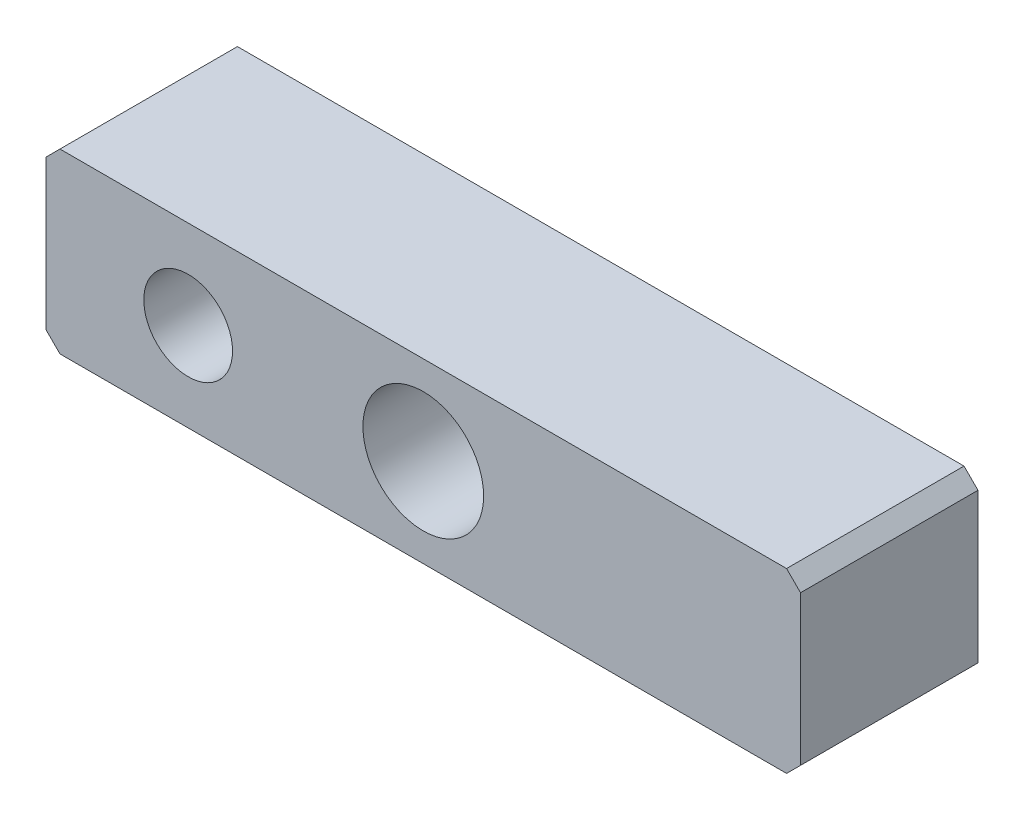
ISO-10303-21;
HEADER;
FILE_DESCRIPTION(('STEP AP214'),'2;1');
FILE_NAME('part.step','',(''),(''),'','','');
FILE_SCHEMA(('AUTOMOTIVE_DESIGN { 1 0 10303 214 1 1 1 1 }'));
ENDSEC;
DATA;
#1=APPLICATION_CONTEXT('core data for automotive mechanical design processes');
#2=APPLICATION_PROTOCOL_DEFINITION('international standard','automotive_design',2000,#1);
#3=PRODUCT_CONTEXT('',#1,'mechanical');
#4=PRODUCT('Part','Part','',(#3));
#5=PRODUCT_RELATED_PRODUCT_CATEGORY('part','',(#4));
#6=PRODUCT_DEFINITION_FORMATION('','',#4);
#7=PRODUCT_DEFINITION_CONTEXT('part definition',#1,'design');
#8=PRODUCT_DEFINITION('design','',#6,#7);
#9=PRODUCT_DEFINITION_SHAPE('','',#8);
#10=(LENGTH_UNIT() NAMED_UNIT(*) SI_UNIT(.MILLI.,.METRE.));
#11=(NAMED_UNIT(*) PLANE_ANGLE_UNIT() SI_UNIT($,.RADIAN.));
#12=(NAMED_UNIT(*) SI_UNIT($,.STERADIAN.) SOLID_ANGLE_UNIT());
#13=UNCERTAINTY_MEASURE_WITH_UNIT(LENGTH_MEASURE(1.E-05),#10,'distance_accuracy_value','');
#14=(GEOMETRIC_REPRESENTATION_CONTEXT(3) GLOBAL_UNCERTAINTY_ASSIGNED_CONTEXT((#13)) GLOBAL_UNIT_ASSIGNED_CONTEXT((#10,
#11,#12)) REPRESENTATION_CONTEXT('',''));
#15=CARTESIAN_POINT('',(0.,0.,0.));
#16=DIRECTION('',(0.,0.,1.));
#17=DIRECTION('',(1.,0.,0.));
#18=AXIS2_PLACEMENT_3D('',#15,#16,#17);
#19=CARTESIAN_POINT('',(0.,6.35,6.35));
#20=DIRECTION('',(0.,0.,-1.));
#21=DIRECTION('',(-1.,0.,0.));
#22=AXIS2_PLACEMENT_3D('',#19,#20,#21);
#23=PLANE('',#22);
#24=DIRECTION('',(0.,-1.,0.));
#25=VECTOR('',#24,1.);
#26=CARTESIAN_POINT('',(0.,0.,6.35));
#27=LINE('',#26,#25);
#28=CARTESIAN_POINT('',(0.,5.85,6.35));
#29=VERTEX_POINT('',#28);
#30=CARTESIAN_POINT('',(0.,0.500000000000004,6.35));
#31=VERTEX_POINT('',#30);
#32=EDGE_CURVE('E136',#29,#31,#27,.T.);
#33=ORIENTED_EDGE('',*,*,#32,.T.);
#34=DIRECTION('',(-0.707106781186545,0.70710678118655,0.));
#35=VECTOR('',#34,1.);
#36=CARTESIAN_POINT('',(0.5,0.,6.35));
#37=LINE('',#36,#35);
#38=CARTESIAN_POINT('',(0.5,0.,6.35));
#39=VERTEX_POINT('',#38);
#40=EDGE_CURVE('E151',#31,#39,#37,.F.);
#41=ORIENTED_EDGE('',*,*,#40,.T.);
#42=DIRECTION('',(1.,0.,0.));
#43=VECTOR('',#42,1.);
#44=CARTESIAN_POINT('',(0.,0.,6.35));
#45=LINE('',#44,#43);
#46=CARTESIAN_POINT('',(26.5,0.,6.35));
#47=VERTEX_POINT('',#46);
#48=EDGE_CURVE('E118',#39,#47,#45,.T.);
#49=ORIENTED_EDGE('',*,*,#48,.T.);
#50=DIRECTION('',(-0.70710678118655,-0.707106781186545,0.));
#51=VECTOR('',#50,1.);
#52=CARTESIAN_POINT('',(27.,0.5,6.35));
#53=LINE('',#52,#51);
#54=CARTESIAN_POINT('',(27.,0.5,6.35));
#55=VERTEX_POINT('',#54);
#56=EDGE_CURVE('E146',#47,#55,#53,.F.);
#57=ORIENTED_EDGE('',*,*,#56,.T.);
#58=DIRECTION('',(0.,1.,0.));
#59=VECTOR('',#58,1.);
#60=CARTESIAN_POINT('',(27.,0.,6.35));
#61=LINE('',#60,#59);
#62=CARTESIAN_POINT('',(27.,5.85,6.35));
#63=VERTEX_POINT('',#62);
#64=EDGE_CURVE('E162',#55,#63,#61,.T.);
#65=ORIENTED_EDGE('',*,*,#64,.T.);
#66=DIRECTION('',(0.707106781186543,-0.707106781186552,0.));
#67=VECTOR('',#66,1.);
#68=CARTESIAN_POINT('',(26.5,6.35,6.35));
#69=LINE('',#68,#67);
#70=CARTESIAN_POINT('',(26.5,6.35,6.35));
#71=VERTEX_POINT('',#70);
#72=EDGE_CURVE('E54',#63,#71,#69,.F.);
#73=ORIENTED_EDGE('',*,*,#72,.T.);
#74=DIRECTION('',(-1.,0.,0.));
#75=VECTOR('',#74,1.);
#76=CARTESIAN_POINT('',(0.,6.35,6.35));
#77=LINE('',#76,#75);
#78=CARTESIAN_POINT('',(0.500000000000004,6.35,6.35));
#79=VERTEX_POINT('',#78);
#80=EDGE_CURVE('E137',#71,#79,#77,.T.);
#81=ORIENTED_EDGE('',*,*,#80,.T.);
#82=DIRECTION('',(0.70710678118655,0.707106781186545,0.));
#83=VECTOR('',#82,1.);
#84=CARTESIAN_POINT('',(0.,5.85,6.35));
#85=LINE('',#84,#83);
#86=EDGE_CURVE('E149',#79,#29,#85,.F.);
#87=ORIENTED_EDGE('',*,*,#86,.T.);
#88=EDGE_LOOP('',(#33,#41,#49,#57,#65,#73,#81,#87));
#89=FACE_BOUND('',#88,.T.);
#90=CARTESIAN_POINT('',(13.5,3.175,6.35));
#91=DIRECTION('',(0.,0.,1.));
#92=DIRECTION('',(1.,0.,0.));
#93=AXIS2_PLACEMENT_3D('',#90,#91,#92);
#94=CIRCLE('',#93,2.16);
#95=CARTESIAN_POINT('',(15.66,3.175,6.35));
#96=VERTEX_POINT('',#95);
#97=EDGE_CURVE('E131',#96,#96,#94,.T.);
#98=ORIENTED_EDGE('',*,*,#97,.F.);
#99=EDGE_LOOP('',(#98));
#100=FACE_BOUND('',#99,.T.);
#101=CARTESIAN_POINT('',(5.0875,3.175,6.35));
#102=DIRECTION('',(0.,0.,1.));
#103=DIRECTION('',(1.,0.,0.));
#104=AXIS2_PLACEMENT_3D('',#101,#102,#103);
#105=CIRCLE('',#104,1.5875);
#106=CARTESIAN_POINT('',(6.675,3.175,6.35));
#107=VERTEX_POINT('',#106);
#108=EDGE_CURVE('E179',#107,#107,#105,.T.);
#109=ORIENTED_EDGE('',*,*,#108,.F.);
#110=EDGE_LOOP('',(#109));
#111=FACE_BOUND('',#110,.T.);
#112=ADVANCED_FACE('F32',(#89,#100,#111),#23,.F.);
#113=CARTESIAN_POINT('',(0.,6.35,0.));
#114=DIRECTION('',(0.,0.,-1.));
#115=DIRECTION('',(-1.,0.,0.));
#116=AXIS2_PLACEMENT_3D('',#113,#114,#115);
#117=PLANE('',#116);
#118=CARTESIAN_POINT('',(13.5,3.175,0.));
#119=DIRECTION('',(0.,0.,1.));
#120=DIRECTION('',(1.,0.,0.));
#121=AXIS2_PLACEMENT_3D('',#118,#119,#120);
#122=CIRCLE('',#121,2.16);
#123=CARTESIAN_POINT('',(15.66,3.175,0.));
#124=VERTEX_POINT('',#123);
#125=EDGE_CURVE('E176',#124,#124,#122,.T.);
#126=ORIENTED_EDGE('',*,*,#125,.T.);
#127=EDGE_LOOP('',(#126));
#128=FACE_BOUND('',#127,.T.);
#129=DIRECTION('',(1.,0.,0.));
#130=VECTOR('',#129,1.);
#131=CARTESIAN_POINT('',(0.,0.,0.));
#132=LINE('',#131,#130);
#133=CARTESIAN_POINT('',(0.5,0.,0.));
#134=VERTEX_POINT('',#133);
#135=CARTESIAN_POINT('',(26.5,0.,0.));
#136=VERTEX_POINT('',#135);
#137=EDGE_CURVE('E115',#134,#136,#132,.T.);
#138=ORIENTED_EDGE('',*,*,#137,.F.);
#139=DIRECTION('',(0.707106781186545,-0.70710678118655,0.));
#140=VECTOR('',#139,1.);
#141=CARTESIAN_POINT('',(-2.925,3.42500000000002,0.));
#142=LINE('',#141,#140);
#143=CARTESIAN_POINT('',(0.,0.500000000000004,0.));
#144=VERTEX_POINT('',#143);
#145=EDGE_CURVE('E98',#134,#144,#142,.F.);
#146=ORIENTED_EDGE('',*,*,#145,.T.);
#147=DIRECTION('',(0.,-1.,0.));
#148=VECTOR('',#147,1.);
#149=CARTESIAN_POINT('',(0.,0.,0.));
#150=LINE('',#149,#148);
#151=CARTESIAN_POINT('',(0.,5.85,0.));
#152=VERTEX_POINT('',#151);
#153=EDGE_CURVE('E126',#152,#144,#150,.T.);
#154=ORIENTED_EDGE('',*,*,#153,.F.);
#155=DIRECTION('',(-0.70710678118655,-0.707106781186545,0.));
#156=VECTOR('',#155,1.);
#157=CARTESIAN_POINT('',(0.25,6.1,0.));
#158=LINE('',#157,#156);
#159=CARTESIAN_POINT('',(0.500000000000004,6.35,0.));
#160=VERTEX_POINT('',#159);
#161=EDGE_CURVE('E109',#152,#160,#158,.F.);
#162=ORIENTED_EDGE('',*,*,#161,.T.);
#163=DIRECTION('',(-1.,0.,0.));
#164=VECTOR('',#163,1.);
#165=CARTESIAN_POINT('',(0.,6.35,0.));
#166=LINE('',#165,#164);
#167=CARTESIAN_POINT('',(26.5,6.35,0.));
#168=VERTEX_POINT('',#167);
#169=EDGE_CURVE('E129',#168,#160,#166,.T.);
#170=ORIENTED_EDGE('',*,*,#169,.F.);
#171=DIRECTION('',(-0.707106781186543,0.707106781186552,0.));
#172=VECTOR('',#171,1.);
#173=CARTESIAN_POINT('',(13.2500000000002,19.6,0.));
#174=LINE('',#173,#172);
#175=CARTESIAN_POINT('',(27.,5.85,0.));
#176=VERTEX_POINT('',#175);
#177=EDGE_CURVE('E140',#168,#176,#174,.F.);
#178=ORIENTED_EDGE('',*,*,#177,.T.);
#179=DIRECTION('',(0.,1.,0.));
#180=VECTOR('',#179,1.);
#181=CARTESIAN_POINT('',(27.,0.,0.));
#182=LINE('',#181,#180);
#183=CARTESIAN_POINT('',(27.,0.5,0.));
#184=VERTEX_POINT('',#183);
#185=EDGE_CURVE('E125',#184,#176,#182,.T.);
#186=ORIENTED_EDGE('',*,*,#185,.F.);
#187=DIRECTION('',(0.70710678118655,0.707106781186545,0.));
#188=VECTOR('',#187,1.);
#189=CARTESIAN_POINT('',(16.4249999999999,-10.075,0.));
#190=LINE('',#189,#188);
#191=EDGE_CURVE('E119',#184,#136,#190,.F.);
#192=ORIENTED_EDGE('',*,*,#191,.T.);
#193=EDGE_LOOP('',(#138,#146,#154,#162,#170,#178,#186,#192));
#194=FACE_BOUND('',#193,.T.);
#195=CARTESIAN_POINT('',(5.0875,3.175,0.));
#196=DIRECTION('',(0.,0.,1.));
#197=DIRECTION('',(1.,0.,0.));
#198=AXIS2_PLACEMENT_3D('',#195,#196,#197);
#199=CIRCLE('',#198,1.5875);
#200=CARTESIAN_POINT('',(6.675,3.175,0.));
#201=VERTEX_POINT('',#200);
#202=EDGE_CURVE('E182',#201,#201,#199,.T.);
#203=ORIENTED_EDGE('',*,*,#202,.T.);
#204=EDGE_LOOP('',(#203));
#205=FACE_BOUND('',#204,.T.);
#206=ADVANCED_FACE('F122',(#128,#194,#205),#117,.T.);
#207=CARTESIAN_POINT('',(0.,0.,6.35));
#208=DIRECTION('',(1.,0.,0.));
#209=DIRECTION('',(0.,0.,-1.));
#210=AXIS2_PLACEMENT_3D('',#207,#208,#209);
#211=PLANE('',#210);
#212=ORIENTED_EDGE('',*,*,#153,.T.);
#213=DIRECTION('',(0.,0.,1.));
#214=VECTOR('',#213,1.);
#215=CARTESIAN_POINT('',(0.,0.500000000000004,6.35));
#216=LINE('',#215,#214);
#217=EDGE_CURVE('E103',#144,#31,#216,.T.);
#218=ORIENTED_EDGE('',*,*,#217,.T.);
#219=ORIENTED_EDGE('',*,*,#32,.F.);
#220=DIRECTION('',(0.,0.,-1.));
#221=VECTOR('',#220,1.);
#222=CARTESIAN_POINT('',(0.,5.85,6.35));
#223=LINE('',#222,#221);
#224=EDGE_CURVE('E108',#29,#152,#223,.T.);
#225=ORIENTED_EDGE('',*,*,#224,.T.);
#226=EDGE_LOOP('',(#212,#218,#219,#225));
#227=FACE_BOUND('',#226,.T.);
#228=ADVANCED_FACE('F196',(#227),#211,.F.);
#229=CARTESIAN_POINT('',(0.,0.,6.35));
#230=DIRECTION('',(0.,1.,0.));
#231=DIRECTION('',(0.,0.,1.));
#232=AXIS2_PLACEMENT_3D('',#229,#230,#231);
#233=PLANE('',#232);
#234=ORIENTED_EDGE('',*,*,#48,.F.);
#235=DIRECTION('',(0.,0.,-1.));
#236=VECTOR('',#235,1.);
#237=CARTESIAN_POINT('',(0.5,0.,6.35));
#238=LINE('',#237,#236);
#239=EDGE_CURVE('E102',#39,#134,#238,.T.);
#240=ORIENTED_EDGE('',*,*,#239,.T.);
#241=ORIENTED_EDGE('',*,*,#137,.T.);
#242=DIRECTION('',(0.,0.,1.));
#243=VECTOR('',#242,1.);
#244=CARTESIAN_POINT('',(26.5,0.,6.35));
#245=LINE('',#244,#243);
#246=EDGE_CURVE('E120',#136,#47,#245,.T.);
#247=ORIENTED_EDGE('',*,*,#246,.T.);
#248=EDGE_LOOP('',(#234,#240,#241,#247));
#249=FACE_BOUND('',#248,.T.);
#250=ADVANCED_FACE('F114',(#249),#233,.F.);
#251=CARTESIAN_POINT('',(27.,0.,6.35));
#252=DIRECTION('',(-1.,0.,0.));
#253=DIRECTION('',(0.,0.,1.));
#254=AXIS2_PLACEMENT_3D('',#251,#252,#253);
#255=PLANE('',#254);
#256=ORIENTED_EDGE('',*,*,#185,.T.);
#257=DIRECTION('',(0.,0.,1.));
#258=VECTOR('',#257,1.);
#259=CARTESIAN_POINT('',(27.,5.85,6.35));
#260=LINE('',#259,#258);
#261=EDGE_CURVE('E11',#176,#63,#260,.T.);
#262=ORIENTED_EDGE('',*,*,#261,.T.);
#263=ORIENTED_EDGE('',*,*,#64,.F.);
#264=DIRECTION('',(0.,0.,-1.));
#265=VECTOR('',#264,1.);
#266=CARTESIAN_POINT('',(27.,0.5,6.35));
#267=LINE('',#266,#265);
#268=EDGE_CURVE('E40',#55,#184,#267,.T.);
#269=ORIENTED_EDGE('',*,*,#268,.T.);
#270=EDGE_LOOP('',(#256,#262,#263,#269));
#271=FACE_BOUND('',#270,.T.);
#272=ADVANCED_FACE('F160',(#271),#255,.F.);
#273=CARTESIAN_POINT('',(0.,6.35,6.35));
#274=DIRECTION('',(0.,-1.,0.));
#275=DIRECTION('',(0.,0.,-1.));
#276=AXIS2_PLACEMENT_3D('',#273,#274,#275);
#277=PLANE('',#276);
#278=ORIENTED_EDGE('',*,*,#169,.T.);
#279=DIRECTION('',(0.,0.,1.));
#280=VECTOR('',#279,1.);
#281=CARTESIAN_POINT('',(0.500000000000004,6.35,6.35));
#282=LINE('',#281,#280);
#283=EDGE_CURVE('E47',#160,#79,#282,.T.);
#284=ORIENTED_EDGE('',*,*,#283,.T.);
#285=ORIENTED_EDGE('',*,*,#80,.F.);
#286=DIRECTION('',(0.,0.,-1.));
#287=VECTOR('',#286,1.);
#288=CARTESIAN_POINT('',(26.5,6.35,6.35));
#289=LINE('',#288,#287);
#290=EDGE_CURVE('E153',#71,#168,#289,.T.);
#291=ORIENTED_EDGE('',*,*,#290,.T.);
#292=EDGE_LOOP('',(#278,#284,#285,#291));
#293=FACE_BOUND('',#292,.T.);
#294=ADVANCED_FACE('F169',(#293),#277,.F.);
#295=CARTESIAN_POINT('',(13.5,3.175,6.35));
#296=DIRECTION('',(0.,0.,-1.));
#297=DIRECTION('',(-1.,0.,0.));
#298=AXIS2_PLACEMENT_3D('',#295,#296,#297);
#299=CYLINDRICAL_SURFACE('',#298,2.16);
#300=ORIENTED_EDGE('',*,*,#97,.T.);
#301=EDGE_LOOP('',(#300));
#302=FACE_BOUND('',#301,.T.);
#303=ORIENTED_EDGE('',*,*,#125,.F.);
#304=EDGE_LOOP('',(#303));
#305=FACE_BOUND('',#304,.T.);
#306=ADVANCED_FACE('F201',(#302,#305),#299,.F.);
#307=CARTESIAN_POINT('',(5.0875,3.175,6.35));
#308=DIRECTION('',(0.,0.,-1.));
#309=DIRECTION('',(-1.,0.,0.));
#310=AXIS2_PLACEMENT_3D('',#307,#308,#309);
#311=CYLINDRICAL_SURFACE('',#310,1.5875);
#312=ORIENTED_EDGE('',*,*,#108,.T.);
#313=EDGE_LOOP('',(#312));
#314=FACE_BOUND('',#313,.T.);
#315=ORIENTED_EDGE('',*,*,#202,.F.);
#316=EDGE_LOOP('',(#315));
#317=FACE_BOUND('',#316,.T.);
#318=ADVANCED_FACE('F188',(#314,#317),#311,.F.);
#319=CARTESIAN_POINT('',(0.5,0.,6.35));
#320=DIRECTION('',(0.70710678118655,0.707106781186545,0.));
#321=DIRECTION('',(0.,0.,-1.));
#322=AXIS2_PLACEMENT_3D('',#319,#320,#321);
#323=PLANE('',#322);
#324=ORIENTED_EDGE('',*,*,#40,.F.);
#325=ORIENTED_EDGE('',*,*,#217,.F.);
#326=ORIENTED_EDGE('',*,*,#145,.F.);
#327=ORIENTED_EDGE('',*,*,#239,.F.);
#328=EDGE_LOOP('',(#324,#325,#326,#327));
#329=FACE_BOUND('',#328,.T.);
#330=ADVANCED_FACE('F101',(#329),#323,.F.);
#331=CARTESIAN_POINT('',(0.,5.85,6.35));
#332=DIRECTION('',(0.707106781186545,-0.70710678118655,0.));
#333=DIRECTION('',(0.,0.,-1.));
#334=AXIS2_PLACEMENT_3D('',#331,#332,#333);
#335=PLANE('',#334);
#336=ORIENTED_EDGE('',*,*,#86,.F.);
#337=ORIENTED_EDGE('',*,*,#283,.F.);
#338=ORIENTED_EDGE('',*,*,#161,.F.);
#339=ORIENTED_EDGE('',*,*,#224,.F.);
#340=EDGE_LOOP('',(#336,#337,#338,#339));
#341=FACE_BOUND('',#340,.T.);
#342=ADVANCED_FACE('F215',(#341),#335,.F.);
#343=CARTESIAN_POINT('',(26.5,6.35,6.35));
#344=DIRECTION('',(-0.707106781186552,-0.707106781186543,0.));
#345=DIRECTION('',(0.,0.,-1.));
#346=AXIS2_PLACEMENT_3D('',#343,#344,#345);
#347=PLANE('',#346);
#348=ORIENTED_EDGE('',*,*,#72,.F.);
#349=ORIENTED_EDGE('',*,*,#261,.F.);
#350=ORIENTED_EDGE('',*,*,#177,.F.);
#351=ORIENTED_EDGE('',*,*,#290,.F.);
#352=EDGE_LOOP('',(#348,#349,#350,#351));
#353=FACE_BOUND('',#352,.T.);
#354=ADVANCED_FACE('F168',(#353),#347,.F.);
#355=CARTESIAN_POINT('',(27.,0.5,6.35));
#356=DIRECTION('',(-0.707106781186545,0.70710678118655,0.));
#357=DIRECTION('',(0.,0.,-1.));
#358=AXIS2_PLACEMENT_3D('',#355,#356,#357);
#359=PLANE('',#358);
#360=ORIENTED_EDGE('',*,*,#56,.F.);
#361=ORIENTED_EDGE('',*,*,#246,.F.);
#362=ORIENTED_EDGE('',*,*,#191,.F.);
#363=ORIENTED_EDGE('',*,*,#268,.F.);
#364=EDGE_LOOP('',(#360,#361,#362,#363));
#365=FACE_BOUND('',#364,.T.);
#366=ADVANCED_FACE('F34',(#365),#359,.F.);
#367=CLOSED_SHELL('',(#112,#206,#228,#250,#272,#294,#306,#318,#330,#342,#354,#366));
#368=MANIFOLD_SOLID_BREP('B2',#367);
#369=ADVANCED_BREP_SHAPE_REPRESENTATION('',(#18,#368),#14);
#370=SHAPE_DEFINITION_REPRESENTATION(#9,#369);
ENDSEC;
END-ISO-10303-21;
